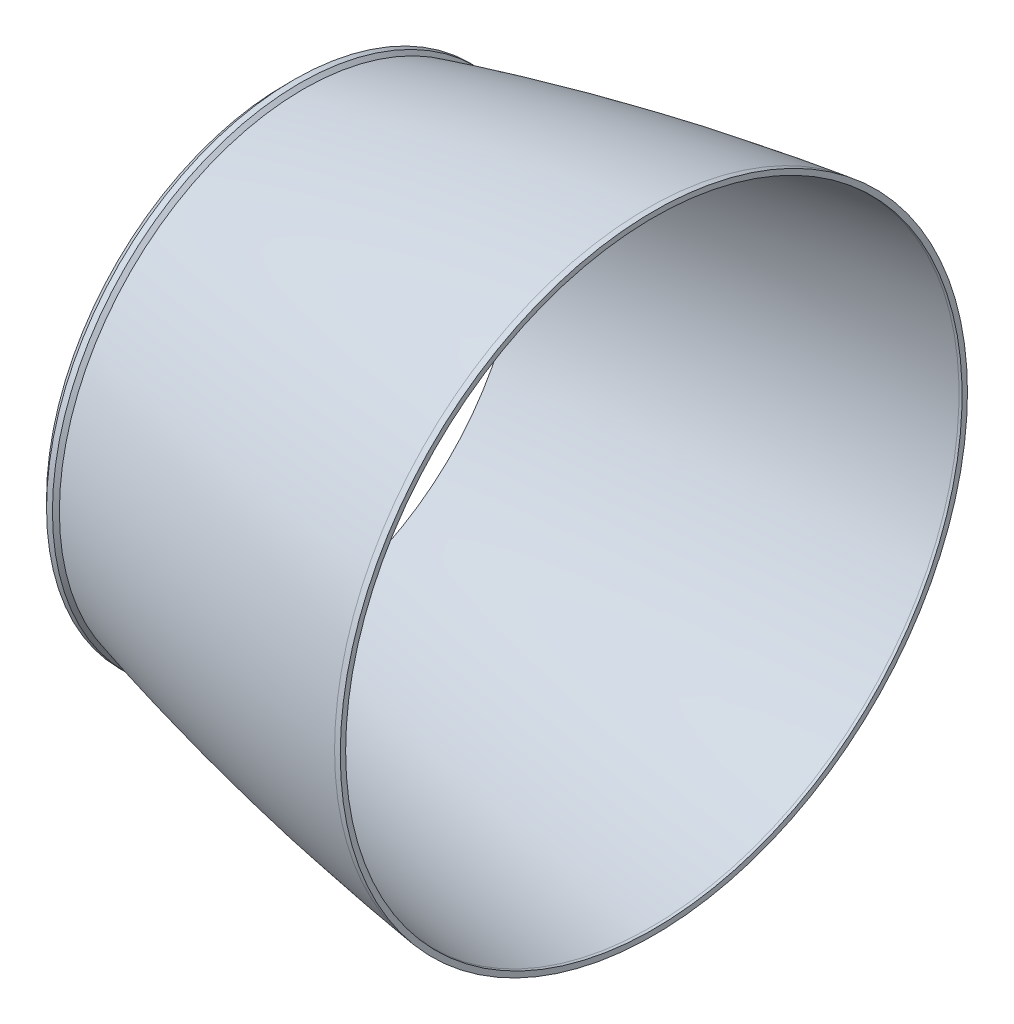
ISO-10303-21;
HEADER;
FILE_DESCRIPTION(('STEP AP214'),'2;1');
FILE_NAME('part.step','',(''),(''),'','','');
FILE_SCHEMA(('AUTOMOTIVE_DESIGN { 1 0 10303 214 1 1 1 1 }'));
ENDSEC;
DATA;
#1=APPLICATION_CONTEXT('core data for automotive mechanical design processes');
#2=APPLICATION_PROTOCOL_DEFINITION('international standard','automotive_design',2000,#1);
#3=PRODUCT_CONTEXT('',#1,'mechanical');
#4=PRODUCT('Part','Part','',(#3));
#5=PRODUCT_RELATED_PRODUCT_CATEGORY('part','',(#4));
#6=PRODUCT_DEFINITION_FORMATION('','',#4);
#7=PRODUCT_DEFINITION_CONTEXT('part definition',#1,'design');
#8=PRODUCT_DEFINITION('design','',#6,#7);
#9=PRODUCT_DEFINITION_SHAPE('','',#8);
#10=(LENGTH_UNIT() NAMED_UNIT(*) SI_UNIT(.MILLI.,.METRE.));
#11=(NAMED_UNIT(*) PLANE_ANGLE_UNIT() SI_UNIT($,.RADIAN.));
#12=(NAMED_UNIT(*) SI_UNIT($,.STERADIAN.) SOLID_ANGLE_UNIT());
#13=UNCERTAINTY_MEASURE_WITH_UNIT(LENGTH_MEASURE(1.E-05),#10,'distance_accuracy_value','');
#14=(GEOMETRIC_REPRESENTATION_CONTEXT(3) GLOBAL_UNCERTAINTY_ASSIGNED_CONTEXT((#13)) GLOBAL_UNIT_ASSIGNED_CONTEXT((#10,
#11,#12)) REPRESENTATION_CONTEXT('',''));
#15=CARTESIAN_POINT('',(0.,0.,0.));
#16=DIRECTION('',(0.,0.,1.));
#17=DIRECTION('',(1.,0.,0.));
#18=AXIS2_PLACEMENT_3D('',#15,#16,#17);
#19=CARTESIAN_POINT('',(379.353962928344,0.,-202.862232347586));
#20=CARTESIAN_POINT('',(403.606244735139,0.,-209.597492364347));
#21=CARTESIAN_POINT('',(453.448114389308,0.,-222.533774022721));
#22=CARTESIAN_POINT('',(529.499752186212,0.,-239.486487565676));
#23=CARTESIAN_POINT('',(594.445991087053,0.,-251.576272303087));
#24=CARTESIAN_POINT('',(646.761950810545,0.,-259.89763572259));
#25=CARTESIAN_POINT('',(673.07243440567,0.,-263.612496520788));
#26=CARTESIAN_POINT('',(686.232087532264,0.,-265.35401711067));
#27=B_SPLINE_CURVE_WITH_KNOTS('',3,(#19,#20,#21,#22,#23,#24,#25,#26),.UNSPECIFIED.,.F.,.F.,(4,1,
1,1,1,4),(0.562910450076892,0.666819764577323,0.775500718210883,0.884181671844444,
0.938522148661224,0.992862625478005),.UNSPECIFIED.);
#28=CARTESIAN_POINT('',(0.,0.,0.));
#29=DIRECTION('',(-1.,0.,0.));
#30=AXIS1_PLACEMENT('',#28,#29);
#31=SURFACE_OF_REVOLUTION('',#27,#30);
#32=CARTESIAN_POINT('',(686.232087532264,0.,0.));
#33=DIRECTION('',(-1.,0.,0.));
#34=DIRECTION('',(0.,0.,1.));
#35=AXIS2_PLACEMENT_3D('',#32,#33,#34);
#36=CIRCLE('',#35,265.35401711067);
#37=CARTESIAN_POINT('',(686.232087532264,0.,265.35401711067));
#38=VERTEX_POINT('',#37);
#39=EDGE_CURVE('E70',#38,#38,#36,.T.);
#40=ORIENTED_EDGE('',*,*,#39,.T.);
#41=EDGE_LOOP('',(#40));
#42=FACE_BOUND('',#41,.T.);
#43=CARTESIAN_POINT('',(394.353962928344,0.,0.));
#44=DIRECTION('',(-1.,0.,0.));
#45=DIRECTION('',(0.,0.,1.));
#46=AXIS2_PLACEMENT_3D('',#43,#44,#45);
#47=CIRCLE('',#46,206.971642395671);
#48=CARTESIAN_POINT('',(394.353962928344,0.,206.971642395671));
#49=VERTEX_POINT('',#48);
#50=EDGE_CURVE('E10',#49,#49,#47,.T.);
#51=ORIENTED_EDGE('',*,*,#50,.F.);
#52=EDGE_LOOP('',(#51));
#53=FACE_BOUND('',#52,.T.);
#54=ADVANCED_FACE('F38',(#42,#53),#31,.F.);
#55=CARTESIAN_POINT('',(391.353962928343,0.,0.));
#56=DIRECTION('',(-1.,0.,0.));
#57=DIRECTION('',(0.,0.,1.));
#58=AXIS2_PLACEMENT_3D('',#55,#56,#57);
#59=CONICAL_SURFACE('',#58,209.862232347586,0.766826599246696);
#60=ORIENTED_EDGE('',*,*,#50,.T.);
#61=EDGE_LOOP('',(#60));
#62=FACE_BOUND('',#61,.T.);
#63=CARTESIAN_POINT('',(391.353962928343,0.,0.));
#64=DIRECTION('',(-1.,0.,0.));
#65=DIRECTION('',(0.,0.,1.));
#66=AXIS2_PLACEMENT_3D('',#63,#64,#65);
#67=CIRCLE('',#66,209.862232347586);
#68=CARTESIAN_POINT('',(391.353962928343,0.,209.862232347586));
#69=VERTEX_POINT('',#68);
#70=EDGE_CURVE('E45',#69,#69,#67,.T.);
#71=ORIENTED_EDGE('',*,*,#70,.F.);
#72=EDGE_LOOP('',(#71));
#73=FACE_BOUND('',#72,.T.);
#74=ADVANCED_FACE('F100',(#62,#73),#59,.T.);
#75=CARTESIAN_POINT('',(0.,0.,0.));
#76=DIRECTION('',(-1.,0.,0.));
#77=DIRECTION('',(0.,0.,1.));
#78=AXIS2_PLACEMENT_3D('',#75,#76,#77);
#79=CYLINDRICAL_SURFACE('',#78,209.862232347586);
#80=ORIENTED_EDGE('',*,*,#70,.T.);
#81=EDGE_LOOP('',(#80));
#82=FACE_BOUND('',#81,.T.);
#83=CARTESIAN_POINT('',(386.353962928343,0.,0.));
#84=DIRECTION('',(-1.,0.,0.));
#85=DIRECTION('',(0.,0.,1.));
#86=AXIS2_PLACEMENT_3D('',#83,#84,#85);
#87=CIRCLE('',#86,209.862232347586);
#88=CARTESIAN_POINT('',(386.353962928343,0.,209.862232347586));
#89=VERTEX_POINT('',#88);
#90=EDGE_CURVE('E49',#89,#89,#87,.T.);
#91=ORIENTED_EDGE('',*,*,#90,.F.);
#92=EDGE_LOOP('',(#91));
#93=FACE_BOUND('',#92,.T.);
#94=ADVANCED_FACE('F97',(#82,#93),#79,.T.);
#95=CARTESIAN_POINT('',(379.353962928344,0.,0.));
#96=DIRECTION('',(1.,0.,0.));
#97=DIRECTION('',(0.,0.,-1.));
#98=AXIS2_PLACEMENT_3D('',#95,#96,#97);
#99=CONICAL_SURFACE('',#98,202.862232347586,0.785398163397448);
#100=ORIENTED_EDGE('',*,*,#90,.T.);
#101=EDGE_LOOP('',(#100));
#102=FACE_BOUND('',#101,.T.);
#103=CARTESIAN_POINT('',(379.353962928344,0.,0.));
#104=DIRECTION('',(-1.,0.,0.));
#105=DIRECTION('',(0.,0.,1.));
#106=AXIS2_PLACEMENT_3D('',#103,#104,#105);
#107=CIRCLE('',#106,202.862232347586);
#108=CARTESIAN_POINT('',(379.353962928344,0.,202.862232347586));
#109=VERTEX_POINT('',#108);
#110=EDGE_CURVE('E53',#109,#109,#107,.T.);
#111=ORIENTED_EDGE('',*,*,#110,.F.);
#112=EDGE_LOOP('',(#111));
#113=FACE_BOUND('',#112,.T.);
#114=ADVANCED_FACE('F93',(#102,#113),#99,.T.);
#115=CARTESIAN_POINT('',(379.353962928344,0.,-4.33166557645419E-12));
#116=DIRECTION('',(1.,0.,0.));
#117=DIRECTION('',(0.,0.,-1.));
#118=AXIS2_PLACEMENT_3D('',#115,#116,#117);
#119=PLANE('',#118);
#120=CARTESIAN_POINT('',(379.353962928344,0.,0.));
#121=DIRECTION('',(-1.,0.,0.));
#122=DIRECTION('',(0.,0.,1.));
#123=AXIS2_PLACEMENT_3D('',#120,#121,#122);
#124=CIRCLE('',#123,198.000736270705);
#125=CARTESIAN_POINT('',(379.353962928344,0.,198.000736270705));
#126=VERTEX_POINT('',#125);
#127=EDGE_CURVE('E58',#126,#126,#124,.T.);
#128=ORIENTED_EDGE('',*,*,#127,.F.);
#129=EDGE_LOOP('',(#128));
#130=FACE_BOUND('',#129,.T.);
#131=ORIENTED_EDGE('',*,*,#110,.T.);
#132=EDGE_LOOP('',(#131));
#133=FACE_BOUND('',#132,.T.);
#134=ADVANCED_FACE('F88',(#130,#133),#119,.F.);
#135=CARTESIAN_POINT('',(379.353962928344,0.,-198.000736270705));
#136=CARTESIAN_POINT('',(404.432804800366,0.,-204.994009283142));
#137=CARTESIAN_POINT('',(455.184428604915,0.,-218.19064139851));
#138=CARTESIAN_POINT('',(532.246171136957,0.,-235.349369031712));
#139=CARTESIAN_POINT('',(597.401499005047,0.,-247.451639797617));
#140=CARTESIAN_POINT('',(649.88789893642,0.,-255.772846044684));
#141=CARTESIAN_POINT('',(676.285219324366,0.,-259.484291913954));
#142=CARTESIAN_POINT('',(689.488161006306,0.,-261.223219958101));
#143=B_SPLINE_CURVE_WITH_KNOTS('',3,(#135,#136,#137,#138,#139,#140,#141,#142),.UNSPECIFIED.,.F.,
.F.,(4,1,1,1,1,4),(0.559677749544632,0.66730327781606,0.776467744688359,0.885632211560657,
0.940214444996806,0.994796678432955),.UNSPECIFIED.);
#144=CARTESIAN_POINT('',(0.,0.,0.));
#145=DIRECTION('',(-1.,0.,0.));
#146=AXIS1_PLACEMENT('',#144,#145);
#147=SURFACE_OF_REVOLUTION('',#143,#146);
#148=CARTESIAN_POINT('',(689.488161006306,0.,0.));
#149=DIRECTION('',(-1.,0.,0.));
#150=DIRECTION('',(0.,0.,1.));
#151=AXIS2_PLACEMENT_3D('',#148,#149,#150);
#152=CIRCLE('',#151,261.223219958101);
#153=CARTESIAN_POINT('',(689.488161006306,0.,261.223219958101));
#154=VERTEX_POINT('',#153);
#155=EDGE_CURVE('E61',#154,#154,#152,.T.);
#156=ORIENTED_EDGE('',*,*,#155,.F.);
#157=EDGE_LOOP('',(#156));
#158=FACE_BOUND('',#157,.T.);
#159=ORIENTED_EDGE('',*,*,#127,.T.);
#160=EDGE_LOOP('',(#159));
#161=FACE_BOUND('',#160,.T.);
#162=ADVANCED_FACE('F83',(#158,#161),#147,.T.);
#163=CARTESIAN_POINT('',(689.488161006306,0.,0.));
#164=DIRECTION('',(1.,0.,0.));
#165=DIRECTION('',(0.,0.,-1.));
#166=AXIS2_PLACEMENT_3D('',#163,#164,#165);
#167=CONICAL_SURFACE('',#166,261.223219958101,0.130974611017339);
#168=CARTESIAN_POINT('',(691.793962928344,0.,0.));
#169=DIRECTION('',(-1.,0.,0.));
#170=DIRECTION('',(0.,0.,1.));
#171=AXIS2_PLACEMENT_3D('',#168,#169,#170);
#172=CIRCLE('',#171,261.526960279912);
#173=CARTESIAN_POINT('',(691.793962928344,0.,261.526960279912));
#174=VERTEX_POINT('',#173);
#175=EDGE_CURVE('E64',#174,#174,#172,.T.);
#176=ORIENTED_EDGE('',*,*,#175,.F.);
#177=EDGE_LOOP('',(#176));
#178=FACE_BOUND('',#177,.T.);
#179=ORIENTED_EDGE('',*,*,#155,.T.);
#180=EDGE_LOOP('',(#179));
#181=FACE_BOUND('',#180,.T.);
#182=ADVANCED_FACE('F87',(#178,#181),#167,.F.);
#183=CARTESIAN_POINT('',(691.793962928344,0.,0.));
#184=DIRECTION('',(1.,0.,0.));
#185=DIRECTION('',(0.,0.,-1.));
#186=AXIS2_PLACEMENT_3D('',#183,#184,#185);
#187=PLANE('',#186);
#188=ORIENTED_EDGE('',*,*,#175,.T.);
#189=EDGE_LOOP('',(#188));
#190=FACE_BOUND('',#189,.T.);
#191=CARTESIAN_POINT('',(691.793962928343,0.,0.));
#192=DIRECTION('',(-1.,0.,0.));
#193=DIRECTION('',(0.,0.,1.));
#194=AXIS2_PLACEMENT_3D('',#191,#192,#193);
#195=CIRCLE('',#194,266.090063906695);
#196=CARTESIAN_POINT('',(691.793962928343,0.,266.090063906695));
#197=VERTEX_POINT('',#196);
#198=EDGE_CURVE('E67',#197,#197,#195,.T.);
#199=ORIENTED_EDGE('',*,*,#198,.F.);
#200=EDGE_LOOP('',(#199));
#201=FACE_BOUND('',#200,.T.);
#202=ADVANCED_FACE('F114',(#190,#201),#187,.T.);
#203=CARTESIAN_POINT('',(686.232087532264,0.,0.));
#204=DIRECTION('',(1.,0.,0.));
#205=DIRECTION('',(0.,0.,-1.));
#206=AXIS2_PLACEMENT_3D('',#203,#204,#205);
#207=CONICAL_SURFACE('',#206,265.35401711067,0.131573339061568);
#208=ORIENTED_EDGE('',*,*,#198,.T.);
#209=EDGE_LOOP('',(#208));
#210=FACE_BOUND('',#209,.T.);
#211=ORIENTED_EDGE('',*,*,#39,.F.);
#212=EDGE_LOOP('',(#211));
#213=FACE_BOUND('',#212,.T.);
#214=ADVANCED_FACE('F112',(#210,#213),#207,.T.);
#215=CLOSED_SHELL('',(#54,#74,#94,#114,#134,#162,#182,#202,#214));
#216=MANIFOLD_SOLID_BREP('B2',#215);
#217=ADVANCED_BREP_SHAPE_REPRESENTATION('',(#18,#216),#14);
#218=SHAPE_DEFINITION_REPRESENTATION(#9,#217);
ENDSEC;
END-ISO-10303-21;
